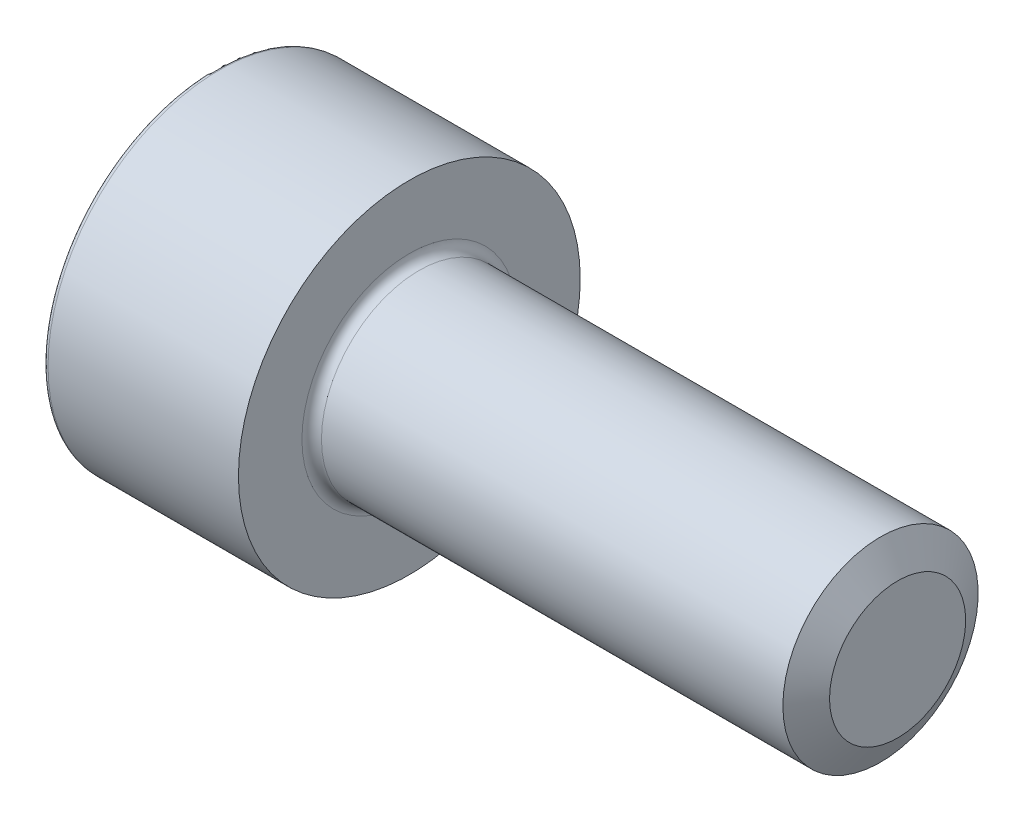
ISO-10303-21;
HEADER;
FILE_DESCRIPTION(('STEP AP214'),'2;1');
FILE_NAME('part.step','',(''),(''),'','','');
FILE_SCHEMA(('AUTOMOTIVE_DESIGN { 1 0 10303 214 1 1 1 1 }'));
ENDSEC;
DATA;
#1=APPLICATION_CONTEXT('core data for automotive mechanical design processes');
#2=APPLICATION_PROTOCOL_DEFINITION('international standard','automotive_design',2000,#1);
#3=PRODUCT_CONTEXT('',#1,'mechanical');
#4=PRODUCT('Part','Part','',(#3));
#5=PRODUCT_RELATED_PRODUCT_CATEGORY('part','',(#4));
#6=PRODUCT_DEFINITION_FORMATION('','',#4);
#7=PRODUCT_DEFINITION_CONTEXT('part definition',#1,'design');
#8=PRODUCT_DEFINITION('design','',#6,#7);
#9=PRODUCT_DEFINITION_SHAPE('','',#8);
#10=(LENGTH_UNIT() NAMED_UNIT(*) SI_UNIT(.MILLI.,.METRE.));
#11=(NAMED_UNIT(*) PLANE_ANGLE_UNIT() SI_UNIT($,.RADIAN.));
#12=(NAMED_UNIT(*) SI_UNIT($,.STERADIAN.) SOLID_ANGLE_UNIT());
#13=UNCERTAINTY_MEASURE_WITH_UNIT(LENGTH_MEASURE(1.E-05),#10,'distance_accuracy_value','');
#14=(GEOMETRIC_REPRESENTATION_CONTEXT(3) GLOBAL_UNCERTAINTY_ASSIGNED_CONTEXT((#13)) GLOBAL_UNIT_ASSIGNED_CONTEXT((#10,
#11,#12)) REPRESENTATION_CONTEXT('',''));
#15=CARTESIAN_POINT('',(0.,0.,0.));
#16=DIRECTION('',(0.,0.,1.));
#17=DIRECTION('',(1.,0.,0.));
#18=AXIS2_PLACEMENT_3D('',#15,#16,#17);
#19=CARTESIAN_POINT('',(0.,0.,0.));
#20=DIRECTION('',(-1.,0.,0.));
#21=DIRECTION('',(0.,0.,1.));
#22=AXIS2_PLACEMENT_3D('',#19,#20,#21);
#23=CYLINDRICAL_SURFACE('',#22,2.);
#24=CARTESIAN_POINT('',(4.2,0.,0.));
#25=DIRECTION('',(-1.,0.,0.));
#26=DIRECTION('',(0.,0.,1.));
#27=AXIS2_PLACEMENT_3D('',#24,#25,#26);
#28=CIRCLE('',#27,2.);
#29=CARTESIAN_POINT('',(4.2,0.,2.));
#30=VERTEX_POINT('',#29);
#31=EDGE_CURVE('E142',#30,#30,#28,.T.);
#32=ORIENTED_EDGE('',*,*,#31,.F.);
#33=EDGE_LOOP('',(#32));
#34=FACE_BOUND('',#33,.T.);
#35=CARTESIAN_POINT('',(13.6500102668172,0.,0.));
#36=DIRECTION('',(-1.,0.,0.));
#37=DIRECTION('',(0.,0.,1.));
#38=AXIS2_PLACEMENT_3D('',#35,#36,#37);
#39=CIRCLE('',#38,2.);
#40=CARTESIAN_POINT('',(13.6500102668172,0.,2.));
#41=VERTEX_POINT('',#40);
#42=EDGE_CURVE('E129',#41,#41,#39,.T.);
#43=ORIENTED_EDGE('',*,*,#42,.T.);
#44=EDGE_LOOP('',(#43));
#45=FACE_BOUND('',#44,.T.);
#46=ADVANCED_FACE('F39',(#34,#45),#23,.T.);
#47=CARTESIAN_POINT('',(0.,0.,0.));
#48=DIRECTION('',(1.,0.,0.));
#49=DIRECTION('',(0.,0.,-1.));
#50=AXIS2_PLACEMENT_3D('',#47,#48,#49);
#51=PLANE('',#50);
#52=CARTESIAN_POINT('',(0.,0.,0.));
#53=DIRECTION('',(1.,0.,0.));
#54=DIRECTION('',(0.,0.,-1.));
#55=AXIS2_PLACEMENT_3D('',#52,#53,#54);
#56=CIRCLE('',#55,3.4);
#57=CARTESIAN_POINT('',(0.,0.,-3.4));
#58=VERTEX_POINT('',#57);
#59=EDGE_CURVE('E47',#58,#58,#56,.F.);
#60=ORIENTED_EDGE('',*,*,#59,.T.);
#61=EDGE_LOOP('',(#60));
#62=FACE_BOUND('',#61,.T.);
#63=DIRECTION('',(0.,0.866025403784438,-0.5));
#64=VECTOR('',#63,1.);
#65=CARTESIAN_POINT('',(0.,0.,1.72));
#66=LINE('',#65,#64);
#67=CARTESIAN_POINT('',(0.,0.,1.72));
#68=VERTEX_POINT('',#67);
#69=CARTESIAN_POINT('',(0.,1.48956369450923,0.859999999999999));
#70=VERTEX_POINT('',#69);
#71=EDGE_CURVE('E128',#68,#70,#66,.T.);
#72=ORIENTED_EDGE('',*,*,#71,.F.);
#73=DIRECTION('',(0.,0.866025403784439,0.5));
#74=VECTOR('',#73,1.);
#75=CARTESIAN_POINT('',(0.,-1.48956369450923,0.86));
#76=LINE('',#75,#74);
#77=CARTESIAN_POINT('',(0.,-1.48956369450923,0.86));
#78=VERTEX_POINT('',#77);
#79=EDGE_CURVE('E54',#78,#68,#76,.T.);
#80=ORIENTED_EDGE('',*,*,#79,.F.);
#81=DIRECTION('',(0.,0.,1.));
#82=VECTOR('',#81,1.);
#83=CARTESIAN_POINT('',(0.,-1.48956369450923,-0.86));
#84=LINE('',#83,#82);
#85=CARTESIAN_POINT('',(0.,-1.48956369450923,-0.86));
#86=VERTEX_POINT('',#85);
#87=EDGE_CURVE('E138',#86,#78,#84,.T.);
#88=ORIENTED_EDGE('',*,*,#87,.F.);
#89=DIRECTION('',(0.,-0.866025403784438,0.5));
#90=VECTOR('',#89,1.);
#91=CARTESIAN_POINT('',(0.,0.,-1.72));
#92=LINE('',#91,#90);
#93=CARTESIAN_POINT('',(0.,0.,-1.72));
#94=VERTEX_POINT('',#93);
#95=EDGE_CURVE('E136',#94,#86,#92,.T.);
#96=ORIENTED_EDGE('',*,*,#95,.F.);
#97=DIRECTION('',(0.,-0.866025403784439,-0.5));
#98=VECTOR('',#97,1.);
#99=CARTESIAN_POINT('',(0.,1.48956369450923,-0.86));
#100=LINE('',#99,#98);
#101=CARTESIAN_POINT('',(0.,1.48956369450923,-0.86));
#102=VERTEX_POINT('',#101);
#103=EDGE_CURVE('E102',#102,#94,#100,.T.);
#104=ORIENTED_EDGE('',*,*,#103,.F.);
#105=DIRECTION('',(0.,0.,-1.));
#106=VECTOR('',#105,1.);
#107=CARTESIAN_POINT('',(0.,1.48956369450923,0.859999999999999));
#108=LINE('',#107,#106);
#109=EDGE_CURVE('E132',#70,#102,#108,.T.);
#110=ORIENTED_EDGE('',*,*,#109,.F.);
#111=EDGE_LOOP('',(#72,#80,#88,#96,#104,#110));
#112=FACE_BOUND('',#111,.T.);
#113=ADVANCED_FACE('F159',(#62,#112),#51,.F.);
#114=CARTESIAN_POINT('',(0.,0.,0.));
#115=DIRECTION('',(-1.,0.,0.));
#116=DIRECTION('',(0.,0.,1.));
#117=AXIS2_PLACEMENT_3D('',#114,#115,#116);
#118=CYLINDRICAL_SURFACE('',#117,3.5);
#119=CARTESIAN_POINT('',(0.1,0.,0.));
#120=DIRECTION('',(1.,0.,0.));
#121=DIRECTION('',(0.,0.,-1.));
#122=AXIS2_PLACEMENT_3D('',#119,#120,#121);
#123=CIRCLE('',#122,3.5);
#124=CARTESIAN_POINT('',(0.1,0.,-3.5));
#125=VERTEX_POINT('',#124);
#126=EDGE_CURVE('E11',#125,#125,#123,.T.);
#127=ORIENTED_EDGE('',*,*,#126,.T.);
#128=EDGE_LOOP('',(#127));
#129=FACE_BOUND('',#128,.T.);
#130=CARTESIAN_POINT('',(4.,0.,0.));
#131=DIRECTION('',(-1.,0.,0.));
#132=DIRECTION('',(0.,0.,1.));
#133=AXIS2_PLACEMENT_3D('',#130,#131,#132);
#134=CIRCLE('',#133,3.5);
#135=CARTESIAN_POINT('',(4.,0.,3.5));
#136=VERTEX_POINT('',#135);
#137=EDGE_CURVE('E153',#136,#136,#134,.T.);
#138=ORIENTED_EDGE('',*,*,#137,.T.);
#139=EDGE_LOOP('',(#138));
#140=FACE_BOUND('',#139,.T.);
#141=ADVANCED_FACE('F178',(#129,#140),#118,.T.);
#142=CARTESIAN_POINT('',(4.,3.5,0.));
#143=DIRECTION('',(-1.,0.,0.));
#144=DIRECTION('',(0.,0.,1.));
#145=AXIS2_PLACEMENT_3D('',#142,#143,#144);
#146=PLANE('',#145);
#147=ORIENTED_EDGE('',*,*,#137,.F.);
#148=EDGE_LOOP('',(#147));
#149=FACE_BOUND('',#148,.T.);
#150=CARTESIAN_POINT('',(4.,0.,0.));
#151=DIRECTION('',(-1.,0.,0.));
#152=DIRECTION('',(0.,0.,1.));
#153=AXIS2_PLACEMENT_3D('',#150,#151,#152);
#154=CIRCLE('',#153,2.2);
#155=CARTESIAN_POINT('',(4.,0.,2.2));
#156=VERTEX_POINT('',#155);
#157=EDGE_CURVE('E150',#156,#156,#154,.T.);
#158=ORIENTED_EDGE('',*,*,#157,.T.);
#159=EDGE_LOOP('',(#158));
#160=FACE_BOUND('',#159,.T.);
#161=ADVANCED_FACE('F187',(#149,#160),#146,.F.);
#162=CARTESIAN_POINT('',(4.2,0.,0.));
#163=DIRECTION('',(-1.,0.,0.));
#164=DIRECTION('',(0.,0.,1.));
#165=AXIS2_PLACEMENT_3D('',#162,#163,#164);
#166=TOROIDAL_SURFACE('',#165,2.2,0.2);
#167=ORIENTED_EDGE('',*,*,#157,.F.);
#168=EDGE_LOOP('',(#167));
#169=FACE_BOUND('',#168,.T.);
#170=ORIENTED_EDGE('',*,*,#31,.T.);
#171=EDGE_LOOP('',(#170));
#172=FACE_BOUND('',#171,.T.);
#173=ADVANCED_FACE('F183',(#169,#172),#166,.F.);
#174=CARTESIAN_POINT('',(2.,-1.48956369450923,0.86));
#175=DIRECTION('',(0.,-0.5,0.866025403784439));
#176=DIRECTION('',(0.,-0.866025403784439,-0.5));
#177=AXIS2_PLACEMENT_3D('',#174,#175,#176);
#178=PLANE('',#177);
#179=ORIENTED_EDGE('',*,*,#79,.T.);
#180=DIRECTION('',(-1.,0.,0.));
#181=VECTOR('',#180,1.);
#182=CARTESIAN_POINT('',(2.,0.,1.72));
#183=LINE('',#182,#181);
#184=CARTESIAN_POINT('',(2.,0.,1.72));
#185=VERTEX_POINT('',#184);
#186=EDGE_CURVE('E84',#185,#68,#183,.T.);
#187=ORIENTED_EDGE('',*,*,#186,.F.);
#188=DIRECTION('',(0.,0.866025403784439,0.5));
#189=VECTOR('',#188,1.);
#190=CARTESIAN_POINT('',(2.,-1.48956369450923,0.86));
#191=LINE('',#190,#189);
#192=CARTESIAN_POINT('',(2.,-1.48956369450923,0.86));
#193=VERTEX_POINT('',#192);
#194=EDGE_CURVE('E140',#193,#185,#191,.T.);
#195=ORIENTED_EDGE('',*,*,#194,.F.);
#196=DIRECTION('',(-1.,0.,0.));
#197=VECTOR('',#196,1.);
#198=CARTESIAN_POINT('',(2.,-1.48956369450923,0.86));
#199=LINE('',#198,#197);
#200=EDGE_CURVE('E62',#193,#78,#199,.T.);
#201=ORIENTED_EDGE('',*,*,#200,.T.);
#202=EDGE_LOOP('',(#179,#187,#195,#201));
#203=FACE_BOUND('',#202,.T.);
#204=ADVANCED_FACE('F186',(#203),#178,.F.);
#205=CARTESIAN_POINT('',(2.,-1.48956369450923,-0.86));
#206=DIRECTION('',(0.,-1.,0.));
#207=DIRECTION('',(0.,0.,-1.));
#208=AXIS2_PLACEMENT_3D('',#205,#206,#207);
#209=PLANE('',#208);
#210=ORIENTED_EDGE('',*,*,#87,.T.);
#211=ORIENTED_EDGE('',*,*,#200,.F.);
#212=DIRECTION('',(0.,0.,1.));
#213=VECTOR('',#212,1.);
#214=CARTESIAN_POINT('',(2.,-1.48956369450923,-0.86));
#215=LINE('',#214,#213);
#216=CARTESIAN_POINT('',(2.,-1.48956369450923,-0.86));
#217=VERTEX_POINT('',#216);
#218=EDGE_CURVE('E114',#217,#193,#215,.T.);
#219=ORIENTED_EDGE('',*,*,#218,.F.);
#220=DIRECTION('',(-1.,0.,0.));
#221=VECTOR('',#220,1.);
#222=CARTESIAN_POINT('',(2.,-1.48956369450923,-0.86));
#223=LINE('',#222,#221);
#224=EDGE_CURVE('E106',#217,#86,#223,.T.);
#225=ORIENTED_EDGE('',*,*,#224,.T.);
#226=EDGE_LOOP('',(#210,#211,#219,#225));
#227=FACE_BOUND('',#226,.T.);
#228=ADVANCED_FACE('F217',(#227),#209,.F.);
#229=CARTESIAN_POINT('',(2.,0.,-1.72));
#230=DIRECTION('',(0.,-0.5,-0.866025403784439));
#231=DIRECTION('',(0.,0.866025403784438,-0.5));
#232=AXIS2_PLACEMENT_3D('',#229,#230,#231);
#233=PLANE('',#232);
#234=ORIENTED_EDGE('',*,*,#95,.T.);
#235=ORIENTED_EDGE('',*,*,#224,.F.);
#236=DIRECTION('',(0.,-0.866025403784438,0.5));
#237=VECTOR('',#236,1.);
#238=CARTESIAN_POINT('',(2.,0.,-1.72));
#239=LINE('',#238,#237);
#240=CARTESIAN_POINT('',(2.,0.,-1.72));
#241=VERTEX_POINT('',#240);
#242=EDGE_CURVE('E110',#241,#217,#239,.T.);
#243=ORIENTED_EDGE('',*,*,#242,.F.);
#244=DIRECTION('',(-1.,0.,0.));
#245=VECTOR('',#244,1.);
#246=CARTESIAN_POINT('',(2.,0.,-1.72));
#247=LINE('',#246,#245);
#248=EDGE_CURVE('E95',#241,#94,#247,.T.);
#249=ORIENTED_EDGE('',*,*,#248,.T.);
#250=EDGE_LOOP('',(#234,#235,#243,#249));
#251=FACE_BOUND('',#250,.T.);
#252=ADVANCED_FACE('F111',(#251),#233,.F.);
#253=CARTESIAN_POINT('',(2.,1.48956369450923,-0.86));
#254=DIRECTION('',(0.,0.5,-0.866025403784439));
#255=DIRECTION('',(0.,0.866025403784439,0.5));
#256=AXIS2_PLACEMENT_3D('',#253,#254,#255);
#257=PLANE('',#256);
#258=ORIENTED_EDGE('',*,*,#103,.T.);
#259=ORIENTED_EDGE('',*,*,#248,.F.);
#260=DIRECTION('',(0.,-0.866025403784439,-0.5));
#261=VECTOR('',#260,1.);
#262=CARTESIAN_POINT('',(2.,1.48956369450923,-0.86));
#263=LINE('',#262,#261);
#264=CARTESIAN_POINT('',(2.,1.48956369450923,-0.86));
#265=VERTEX_POINT('',#264);
#266=EDGE_CURVE('E99',#265,#241,#263,.T.);
#267=ORIENTED_EDGE('',*,*,#266,.F.);
#268=DIRECTION('',(-1.,0.,0.));
#269=VECTOR('',#268,1.);
#270=CARTESIAN_POINT('',(2.,1.48956369450923,-0.86));
#271=LINE('',#270,#269);
#272=EDGE_CURVE('E107',#265,#102,#271,.T.);
#273=ORIENTED_EDGE('',*,*,#272,.T.);
#274=EDGE_LOOP('',(#258,#259,#267,#273));
#275=FACE_BOUND('',#274,.T.);
#276=ADVANCED_FACE('F97',(#275),#257,.F.);
#277=CARTESIAN_POINT('',(2.,1.48956369450923,0.859999999999999));
#278=DIRECTION('',(0.,1.,0.));
#279=DIRECTION('',(0.,0.,1.));
#280=AXIS2_PLACEMENT_3D('',#277,#278,#279);
#281=PLANE('',#280);
#282=ORIENTED_EDGE('',*,*,#109,.T.);
#283=ORIENTED_EDGE('',*,*,#272,.F.);
#284=DIRECTION('',(0.,0.,-1.));
#285=VECTOR('',#284,1.);
#286=CARTESIAN_POINT('',(2.,1.48956369450923,0.859999999999999));
#287=LINE('',#286,#285);
#288=CARTESIAN_POINT('',(2.,1.48956369450923,0.859999999999999));
#289=VERTEX_POINT('',#288);
#290=EDGE_CURVE('E120',#289,#265,#287,.T.);
#291=ORIENTED_EDGE('',*,*,#290,.F.);
#292=DIRECTION('',(-1.,0.,0.));
#293=VECTOR('',#292,1.);
#294=CARTESIAN_POINT('',(2.,1.48956369450923,0.859999999999999));
#295=LINE('',#294,#293);
#296=EDGE_CURVE('E145',#289,#70,#295,.T.);
#297=ORIENTED_EDGE('',*,*,#296,.T.);
#298=EDGE_LOOP('',(#282,#283,#291,#297));
#299=FACE_BOUND('',#298,.T.);
#300=ADVANCED_FACE('F235',(#299),#281,.F.);
#301=CARTESIAN_POINT('',(2.,0.,1.72));
#302=DIRECTION('',(0.,0.5,0.866025403784439));
#303=DIRECTION('',(0.,-0.866025403784438,0.5));
#304=AXIS2_PLACEMENT_3D('',#301,#302,#303);
#305=PLANE('',#304);
#306=ORIENTED_EDGE('',*,*,#71,.T.);
#307=ORIENTED_EDGE('',*,*,#296,.F.);
#308=DIRECTION('',(0.,0.866025403784438,-0.5));
#309=VECTOR('',#308,1.);
#310=CARTESIAN_POINT('',(2.,0.,1.72));
#311=LINE('',#310,#309);
#312=EDGE_CURVE('E122',#185,#289,#311,.T.);
#313=ORIENTED_EDGE('',*,*,#312,.F.);
#314=ORIENTED_EDGE('',*,*,#186,.T.);
#315=EDGE_LOOP('',(#306,#307,#313,#314));
#316=FACE_BOUND('',#315,.T.);
#317=ADVANCED_FACE('F242',(#316),#305,.F.);
#318=CARTESIAN_POINT('',(2.,1.48956369450923,2.58));
#319=DIRECTION('',(-1.,0.,0.));
#320=DIRECTION('',(0.,0.,1.));
#321=AXIS2_PLACEMENT_3D('',#318,#319,#320);
#322=PLANE('',#321);
#323=ORIENTED_EDGE('',*,*,#194,.T.);
#324=ORIENTED_EDGE('',*,*,#312,.T.);
#325=ORIENTED_EDGE('',*,*,#290,.T.);
#326=ORIENTED_EDGE('',*,*,#266,.T.);
#327=ORIENTED_EDGE('',*,*,#242,.T.);
#328=ORIENTED_EDGE('',*,*,#218,.T.);
#329=EDGE_LOOP('',(#323,#324,#325,#326,#327,#328));
#330=FACE_BOUND('',#329,.T.);
#331=ADVANCED_FACE('F117',(#330),#322,.T.);
#332=CARTESIAN_POINT('',(13.6500102668172,0.,0.));
#333=DIRECTION('',(-1.,0.,0.));
#334=DIRECTION('',(0.,0.,1.));
#335=AXIS2_PLACEMENT_3D('',#332,#333,#334);
#336=CONICAL_SURFACE('',#335,2.,1.0471975511966);
#337=CARTESIAN_POINT('',(14.,0.,0.));
#338=DIRECTION('',(-1.,0.,0.));
#339=DIRECTION('',(0.,0.,1.));
#340=AXIS2_PLACEMENT_3D('',#337,#338,#339);
#341=CIRCLE('',#340,1.3938);
#342=CARTESIAN_POINT('',(14.,0.,1.3938));
#343=VERTEX_POINT('',#342);
#344=EDGE_CURVE('E277',#343,#343,#341,.T.);
#345=ORIENTED_EDGE('',*,*,#344,.T.);
#346=EDGE_LOOP('',(#345));
#347=FACE_BOUND('',#346,.T.);
#348=ORIENTED_EDGE('',*,*,#42,.F.);
#349=EDGE_LOOP('',(#348));
#350=FACE_BOUND('',#349,.T.);
#351=ADVANCED_FACE('F168',(#347,#350),#336,.T.);
#352=CARTESIAN_POINT('',(14.,2.,0.));
#353=DIRECTION('',(-1.,0.,0.));
#354=DIRECTION('',(0.,0.,1.));
#355=AXIS2_PLACEMENT_3D('',#352,#353,#354);
#356=PLANE('',#355);
#357=ORIENTED_EDGE('',*,*,#344,.F.);
#358=EDGE_LOOP('',(#357));
#359=FACE_BOUND('',#358,.T.);
#360=ADVANCED_FACE('F163',(#359),#356,.F.);
#361=CARTESIAN_POINT('',(0.1,0.,0.));
#362=DIRECTION('',(1.,0.,0.));
#363=DIRECTION('',(0.,0.,-1.));
#364=AXIS2_PLACEMENT_3D('',#361,#362,#363);
#365=TOROIDAL_SURFACE('',#364,3.4,0.1);
#366=ORIENTED_EDGE('',*,*,#126,.F.);
#367=EDGE_LOOP('',(#366));
#368=FACE_BOUND('',#367,.T.);
#369=ORIENTED_EDGE('',*,*,#59,.F.);
#370=EDGE_LOOP('',(#369));
#371=FACE_BOUND('',#370,.T.);
#372=ADVANCED_FACE('F41',(#368,#371),#365,.T.);
#373=CLOSED_SHELL('',(#46,#113,#141,#161,#173,#204,#228,#252,#276,#300,#317,#331,#351,#360,#372));
#374=MANIFOLD_SOLID_BREP('B2',#373);
#375=ADVANCED_BREP_SHAPE_REPRESENTATION('',(#18,#374),#14);
#376=SHAPE_DEFINITION_REPRESENTATION(#9,#375);
ENDSEC;
END-ISO-10303-21;
